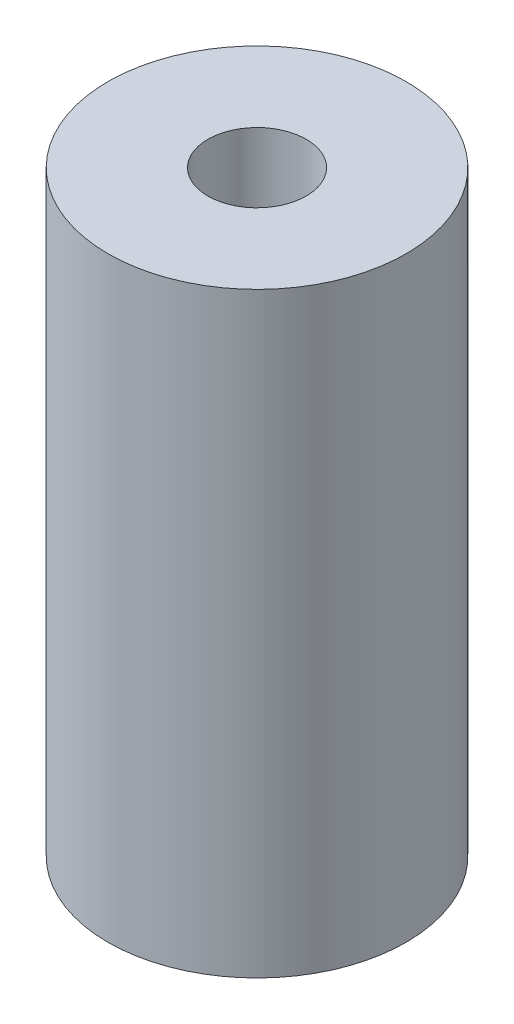
ISO-10303-21;
HEADER;
FILE_DESCRIPTION(('STEP AP214'),'2;1');
FILE_NAME('part.step','',(''),(''),'','','');
FILE_SCHEMA(('AUTOMOTIVE_DESIGN { 1 0 10303 214 1 1 1 1 }'));
ENDSEC;
DATA;
#1=APPLICATION_CONTEXT('core data for automotive mechanical design processes');
#2=APPLICATION_PROTOCOL_DEFINITION('international standard','automotive_design',2000,#1);
#3=PRODUCT_CONTEXT('',#1,'mechanical');
#4=PRODUCT('Part','Part','',(#3));
#5=PRODUCT_RELATED_PRODUCT_CATEGORY('part','',(#4));
#6=PRODUCT_DEFINITION_FORMATION('','',#4);
#7=PRODUCT_DEFINITION_CONTEXT('part definition',#1,'design');
#8=PRODUCT_DEFINITION('design','',#6,#7);
#9=PRODUCT_DEFINITION_SHAPE('','',#8);
#10=(LENGTH_UNIT() NAMED_UNIT(*) SI_UNIT(.MILLI.,.METRE.));
#11=(NAMED_UNIT(*) PLANE_ANGLE_UNIT() SI_UNIT($,.RADIAN.));
#12=(NAMED_UNIT(*) SI_UNIT($,.STERADIAN.) SOLID_ANGLE_UNIT());
#13=UNCERTAINTY_MEASURE_WITH_UNIT(LENGTH_MEASURE(1.E-05),#10,'distance_accuracy_value','');
#14=(GEOMETRIC_REPRESENTATION_CONTEXT(3) GLOBAL_UNCERTAINTY_ASSIGNED_CONTEXT((#13)) GLOBAL_UNIT_ASSIGNED_CONTEXT((#10,
#11,#12)) REPRESENTATION_CONTEXT('',''));
#15=CARTESIAN_POINT('',(0.,0.,0.));
#16=DIRECTION('',(0.,0.,1.));
#17=DIRECTION('',(1.,0.,0.));
#18=AXIS2_PLACEMENT_3D('',#15,#16,#17);
#19=CARTESIAN_POINT('',(0.,20.,0.));
#20=DIRECTION('',(0.,-1.,0.));
#21=DIRECTION('',(0.,0.,-1.));
#22=AXIS2_PLACEMENT_3D('',#19,#20,#21);
#23=CYLINDRICAL_SURFACE('',#22,5.);
#24=CARTESIAN_POINT('',(0.,20.,0.));
#25=DIRECTION('',(0.,1.,0.));
#26=DIRECTION('',(0.,0.,1.));
#27=AXIS2_PLACEMENT_3D('',#24,#25,#26);
#28=CIRCLE('',#27,5.);
#29=CARTESIAN_POINT('',(0.,20.,5.));
#30=VERTEX_POINT('',#29);
#31=EDGE_CURVE('E10',#30,#30,#28,.T.);
#32=ORIENTED_EDGE('',*,*,#31,.F.);
#33=EDGE_LOOP('',(#32));
#34=FACE_BOUND('',#33,.T.);
#35=CARTESIAN_POINT('',(0.,0.,0.));
#36=DIRECTION('',(0.,1.,0.));
#37=DIRECTION('',(0.,0.,1.));
#38=AXIS2_PLACEMENT_3D('',#35,#36,#37);
#39=CIRCLE('',#38,5.);
#40=CARTESIAN_POINT('',(0.,0.,5.));
#41=VERTEX_POINT('',#40);
#42=EDGE_CURVE('E40',#41,#41,#39,.T.);
#43=ORIENTED_EDGE('',*,*,#42,.T.);
#44=EDGE_LOOP('',(#43));
#45=FACE_BOUND('',#44,.T.);
#46=ADVANCED_FACE('F37',(#34,#45),#23,.T.);
#47=CARTESIAN_POINT('',(0.,20.,0.));
#48=DIRECTION('',(0.,1.,0.));
#49=DIRECTION('',(0.,0.,1.));
#50=AXIS2_PLACEMENT_3D('',#47,#48,#49);
#51=PLANE('',#50);
#52=CARTESIAN_POINT('',(0.,20.,0.));
#53=DIRECTION('',(0.,1.,0.));
#54=DIRECTION('',(0.,0.,1.));
#55=AXIS2_PLACEMENT_3D('',#52,#53,#54);
#56=CIRCLE('',#55,1.64999999999999);
#57=CARTESIAN_POINT('',(0.,20.,1.64999999999999));
#58=VERTEX_POINT('',#57);
#59=EDGE_CURVE('E51',#58,#58,#56,.T.);
#60=ORIENTED_EDGE('',*,*,#59,.F.);
#61=EDGE_LOOP('',(#60));
#62=FACE_BOUND('',#61,.T.);
#63=ORIENTED_EDGE('',*,*,#31,.T.);
#64=EDGE_LOOP('',(#63));
#65=FACE_BOUND('',#64,.T.);
#66=ADVANCED_FACE('F57',(#62,#65),#51,.T.);
#67=CARTESIAN_POINT('',(0.,0.,0.));
#68=DIRECTION('',(0.,1.,0.));
#69=DIRECTION('',(0.,0.,1.));
#70=AXIS2_PLACEMENT_3D('',#67,#68,#69);
#71=PLANE('',#70);
#72=CARTESIAN_POINT('',(0.,0.,0.));
#73=DIRECTION('',(0.,1.,0.));
#74=DIRECTION('',(0.,0.,1.));
#75=AXIS2_PLACEMENT_3D('',#72,#73,#74);
#76=CIRCLE('',#75,1.64999999999999);
#77=CARTESIAN_POINT('',(0.,0.,1.64999999999999));
#78=VERTEX_POINT('',#77);
#79=EDGE_CURVE('E47',#78,#78,#76,.T.);
#80=ORIENTED_EDGE('',*,*,#79,.T.);
#81=EDGE_LOOP('',(#80));
#82=FACE_BOUND('',#81,.T.);
#83=ORIENTED_EDGE('',*,*,#42,.F.);
#84=EDGE_LOOP('',(#83));
#85=FACE_BOUND('',#84,.T.);
#86=ADVANCED_FACE('F59',(#82,#85),#71,.F.);
#87=CARTESIAN_POINT('',(0.,20.,0.));
#88=DIRECTION('',(0.,1.,0.));
#89=DIRECTION('',(0.,0.,1.));
#90=AXIS2_PLACEMENT_3D('',#87,#88,#89);
#91=CYLINDRICAL_SURFACE('',#90,1.64999999999999);
#92=ORIENTED_EDGE('',*,*,#79,.F.);
#93=EDGE_LOOP('',(#92));
#94=FACE_BOUND('',#93,.T.);
#95=ORIENTED_EDGE('',*,*,#59,.T.);
#96=EDGE_LOOP('',(#95));
#97=FACE_BOUND('',#96,.T.);
#98=ADVANCED_FACE('F55',(#94,#97),#91,.F.);
#99=CLOSED_SHELL('',(#46,#66,#86,#98));
#100=MANIFOLD_SOLID_BREP('B2',#99);
#101=ADVANCED_BREP_SHAPE_REPRESENTATION('',(#18,#100),#14);
#102=SHAPE_DEFINITION_REPRESENTATION(#9,#101);
ENDSEC;
END-ISO-10303-21;
